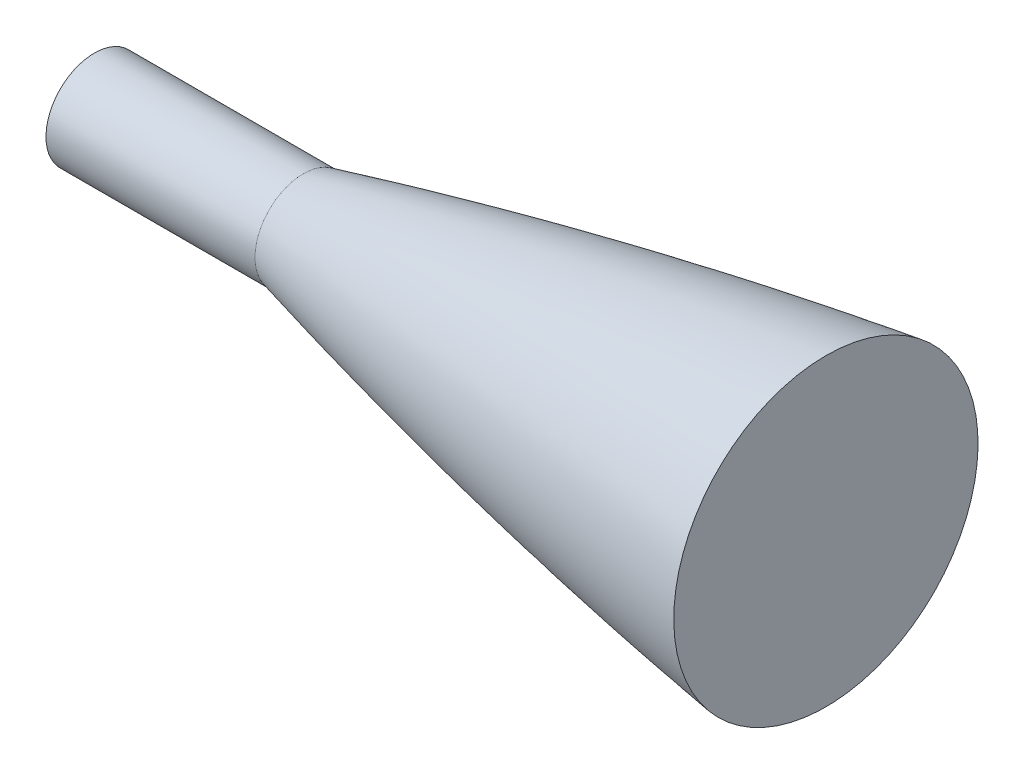
ISO-10303-21;
HEADER;
FILE_DESCRIPTION(('STEP AP214'),'2;1');
FILE_NAME('part.step','',(''),(''),'','','');
FILE_SCHEMA(('AUTOMOTIVE_DESIGN { 1 0 10303 214 1 1 1 1 }'));
ENDSEC;
DATA;
#1=APPLICATION_CONTEXT('core data for automotive mechanical design processes');
#2=APPLICATION_PROTOCOL_DEFINITION('international standard','automotive_design',2000,#1);
#3=PRODUCT_CONTEXT('',#1,'mechanical');
#4=PRODUCT('Part','Part','',(#3));
#5=PRODUCT_RELATED_PRODUCT_CATEGORY('part','',(#4));
#6=PRODUCT_DEFINITION_FORMATION('','',#4);
#7=PRODUCT_DEFINITION_CONTEXT('part definition',#1,'design');
#8=PRODUCT_DEFINITION('design','',#6,#7);
#9=PRODUCT_DEFINITION_SHAPE('','',#8);
#10=(LENGTH_UNIT() NAMED_UNIT(*) SI_UNIT(.MILLI.,.METRE.));
#11=(NAMED_UNIT(*) PLANE_ANGLE_UNIT() SI_UNIT($,.RADIAN.));
#12=(NAMED_UNIT(*) SI_UNIT($,.STERADIAN.) SOLID_ANGLE_UNIT());
#13=UNCERTAINTY_MEASURE_WITH_UNIT(LENGTH_MEASURE(1.E-05),#10,'distance_accuracy_value','');
#14=(GEOMETRIC_REPRESENTATION_CONTEXT(3) GLOBAL_UNCERTAINTY_ASSIGNED_CONTEXT((#13)) GLOBAL_UNIT_ASSIGNED_CONTEXT((#10,
#11,#12)) REPRESENTATION_CONTEXT('',''));
#15=CARTESIAN_POINT('',(0.,0.,0.));
#16=DIRECTION('',(0.,0.,1.));
#17=DIRECTION('',(1.,0.,0.));
#18=AXIS2_PLACEMENT_3D('',#15,#16,#17);
#19=CARTESIAN_POINT('',(304.799999990287,49.7839999999356,0.));
#20=CARTESIAN_POINT('',(304.362420109321,49.7839999999268,0.));
#21=CARTESIAN_POINT('',(303.482211221152,49.7834088052548,0.));
#22=CARTESIAN_POINT('',(301.617177870666,49.7807484292649,0.));
#23=CARTESIAN_POINT('',(299.535126271052,49.7736541034944,0.));
#24=CARTESIAN_POINT('',(297.470177020612,49.7630126402219,0.));
#25=CARTESIAN_POINT('',(295.35918685804,49.7488240698795,0.));
#26=CARTESIAN_POINT('',(293.263778354198,49.7310884330478,0.));
#27=CARTESIAN_POINT('',(291.166731436806,49.7098057804495,0.));
#28=CARTESIAN_POINT('',(288.521672795546,49.6784952503172,0.));
#29=CARTESIAN_POINT('',(285.329649652529,49.6334265452577,0.));
#30=CARTESIAN_POINT('',(281.590188304048,49.5699030834589,0.));
#31=CARTESIAN_POINT('',(277.303691578309,49.48226239004,0.));
#32=CARTESIAN_POINT('',(273.017475856952,49.3798045532393,0.));
#33=CARTESIAN_POINT('',(268.731666264679,49.262530797284,0.));
#34=CARTESIAN_POINT('',(264.446272338637,49.1304425234462,0.));
#35=CARTESIAN_POINT('',(260.161369668181,48.9835413100188,0.));
#36=CARTESIAN_POINT('',(253.734807706703,48.7409727135402,0.));
#37=CARTESIAN_POINT('',(245.168015053762,48.3681837485972,0.));
#38=CARTESIAN_POINT('',(207.702302927604,46.4349626079382,0.));
#39=CARTESIAN_POINT('',(160.707329089507,42.1599209125125,0.));
#40=CARTESIAN_POINT('',(110.770450736802,35.2251211949369,0.));
#41=CARTESIAN_POINT('',(62.3339038753587,25.9763701994142,0.));
#42=CARTESIAN_POINT('',(42.4128979252964,21.742539101878,0.));
#43=CARTESIAN_POINT('',(31.9521680351812,19.4056754890413,0.));
#44=CARTESIAN_POINT('',(26.7272384393463,18.2131472626268,0.));
#45=CARTESIAN_POINT('',(22.5506525227574,17.2446900479098,0.));
#46=CARTESIAN_POINT('',(18.9102609099226,16.3872914736853,0.));
#47=CARTESIAN_POINT('',(15.8050492233456,15.6465359898865,0.));
#48=CARTESIAN_POINT('',(13.2334128844101,15.0268619640981,0.));
#49=CARTESIAN_POINT('',(11.1954442275076,14.5321411193525,0.));
#50=CARTESIAN_POINT('',(9.15994822447513,14.0343879217128,0.));
#51=CARTESIAN_POINT('',(7.11012855188908,13.5293440242189,0.));
#52=CARTESIAN_POINT('',(5.10622259628834,13.032281092588,0.));
#53=CARTESIAN_POINT('',(3.08541050477275,12.5272726670259,0.));
#54=CARTESIAN_POINT('',(1.27776800563499,12.0717339202754,0.));
#55=CARTESIAN_POINT('',(0.424160674864923,11.8559326777936,0.));
#56=CARTESIAN_POINT('',(-8.94262127456441E-09,11.7483971703143,0.));
#57=B_SPLINE_CURVE_WITH_KNOTS('',4,(#19,#20,#21,#22,#23,#24,#25,#26,#27,#28,#29,#30,#31,#32,#33,
#34,#35,#36,#37,#38,#39,#40,#41,#42,#43,#44,#45,#46,#47,#48,#49,#50,#51,#52,#53,#54,#55,#56),
.UNSPECIFIED.,.F.,.F.,(5,1,1,1,1,1,1,1,1,1,1,1,1,1,1,1,1,1,1,1,1,1,1,1,1,1,1,1,1,1,1,1,1,1,5),
(0.0829178151015879,0.0886015106363571,0.0942852061412064,0.0999689016460558,0.105652597150905,
0.111336292655755,0.117019988160604,0.122703683665453,0.128387379170303,0.140005214528904,
0.151623049887505,0.163240885246106,0.174858720604706,0.18647655605003,0.198094391495354,
0.209712226940678,0.221330062386002,0.256183568844847,0.291037074687809,0.616336464163029,
0.732514817876367,0.802221831447538,0.825457500655397,0.837075336998531,0.848693173341665,
0.8603110096848,0.871928846027934,0.877612541812259,0.883296237596584,0.888979933380909,
0.894663629165234,0.900347324949559,0.906031020733883,0.911714716518208,0.917398412270913),.UNSPECIFIED.);
#58=CARTESIAN_POINT('',(304.799999999505,0.,0.));
#59=DIRECTION('',(1.,0.,0.));
#60=AXIS1_PLACEMENT('',#58,#59);
#61=SURFACE_OF_REVOLUTION('',#57,#60);
#62=CARTESIAN_POINT('',(0.,0.,0.));
#63=DIRECTION('',(-1.,0.,0.));
#64=DIRECTION('',(0.,-1.,0.));
#65=AXIS2_PLACEMENT_3D('',#62,#63,#64);
#66=CIRCLE('',#65,11.7483971703143);
#67=CARTESIAN_POINT('',(0.,-11.7483971703143,0.));
#68=VERTEX_POINT('',#67);
#69=EDGE_CURVE('E48',#68,#68,#66,.T.);
#70=ORIENTED_EDGE('',*,*,#69,.F.);
#71=EDGE_LOOP('',(#70));
#72=FACE_BOUND('',#71,.T.);
#73=CARTESIAN_POINT('',(126.999999999505,0.,0.));
#74=DIRECTION('',(1.,0.,0.));
#75=DIRECTION('',(0.,1.,0.));
#76=AXIS2_PLACEMENT_3D('',#73,#74,#75);
#77=CIRCLE('',#76,36.9736278029773);
#78=CARTESIAN_POINT('',(126.999999999505,36.9736278029773,0.));
#79=VERTEX_POINT('',#78);
#80=EDGE_CURVE('E44',#79,#79,#77,.F.);
#81=ORIENTED_EDGE('',*,*,#80,.T.);
#82=EDGE_LOOP('',(#81));
#83=FACE_BOUND('',#82,.T.);
#84=ADVANCED_FACE('F40',(#72,#83),#61,.F.);
#85=CARTESIAN_POINT('',(-50.8,0.,0.));
#86=DIRECTION('',(1.,0.,0.));
#87=DIRECTION('',(0.,1.,0.));
#88=AXIS2_PLACEMENT_3D('',#85,#86,#87);
#89=CYLINDRICAL_SURFACE('',#88,11.7483971703143);
#90=CARTESIAN_POINT('',(-50.8,0.,0.));
#91=DIRECTION('',(-1.,0.,0.));
#92=DIRECTION('',(0.,-1.,0.));
#93=AXIS2_PLACEMENT_3D('',#90,#91,#92);
#94=CIRCLE('',#93,11.7483971703143);
#95=CARTESIAN_POINT('',(-50.8,-11.7483971703143,0.));
#96=VERTEX_POINT('',#95);
#97=EDGE_CURVE('E10',#96,#96,#94,.T.);
#98=ORIENTED_EDGE('',*,*,#97,.F.);
#99=EDGE_LOOP('',(#98));
#100=FACE_BOUND('',#99,.T.);
#101=ORIENTED_EDGE('',*,*,#69,.T.);
#102=EDGE_LOOP('',(#101));
#103=FACE_BOUND('',#102,.T.);
#104=ADVANCED_FACE('F76',(#100,#103),#89,.T.);
#105=CARTESIAN_POINT('',(-50.8,0.,0.));
#106=DIRECTION('',(-1.,0.,0.));
#107=DIRECTION('',(0.,-1.,0.));
#108=AXIS2_PLACEMENT_3D('',#105,#106,#107);
#109=PLANE('',#108);
#110=ORIENTED_EDGE('',*,*,#97,.T.);
#111=EDGE_LOOP('',(#110));
#112=FACE_BOUND('',#111,.T.);
#113=ADVANCED_FACE('F70',(#112),#109,.T.);
#114=CARTESIAN_POINT('',(126.999999999505,0.,0.));
#115=DIRECTION('',(1.,0.,0.));
#116=DIRECTION('',(0.,1.,0.));
#117=AXIS2_PLACEMENT_3D('',#114,#115,#116);
#118=PLANE('',#117);
#119=ORIENTED_EDGE('',*,*,#80,.F.);
#120=EDGE_LOOP('',(#119));
#121=FACE_BOUND('',#120,.T.);
#122=ADVANCED_FACE('F68',(#121),#118,.T.);
#123=CLOSED_SHELL('',(#84,#104,#113,#122));
#124=MANIFOLD_SOLID_BREP('B2',#123);
#125=ADVANCED_BREP_SHAPE_REPRESENTATION('',(#18,#124),#14);
#126=SHAPE_DEFINITION_REPRESENTATION(#9,#125);
ENDSEC;
END-ISO-10303-21;
